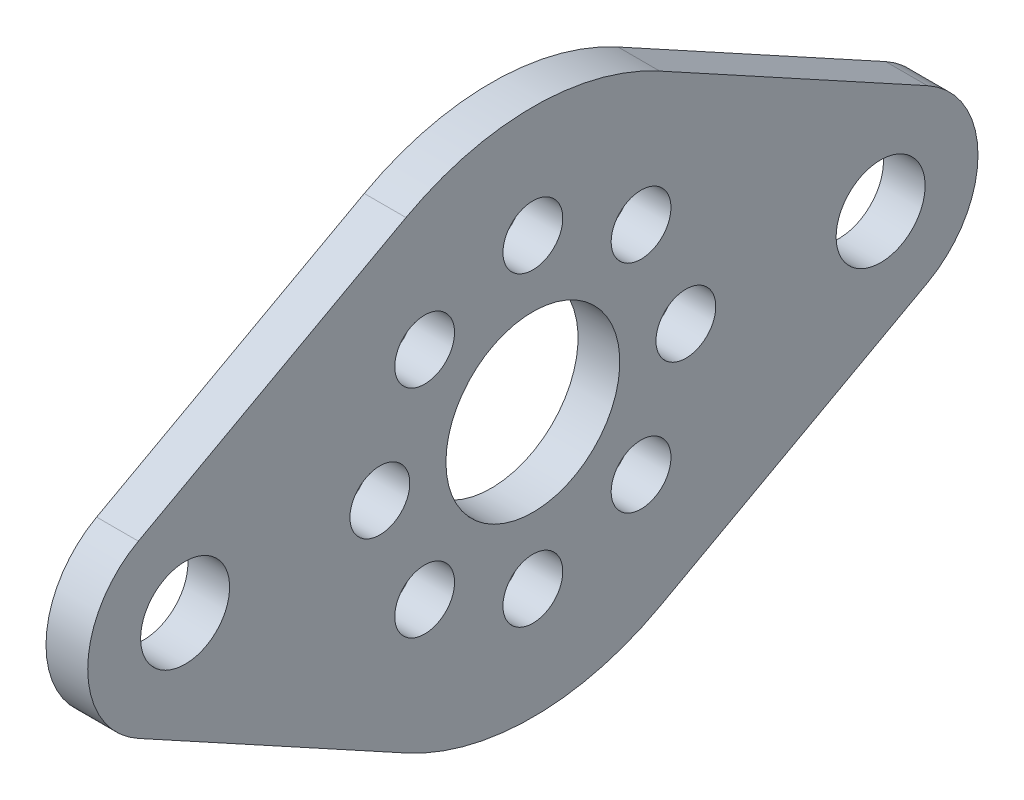
ISO-10303-21;
HEADER;
FILE_DESCRIPTION(('STEP AP214'),'2;1');
FILE_NAME('part.step','',(''),(''),'','','');
FILE_SCHEMA(('AUTOMOTIVE_DESIGN { 1 0 10303 214 1 1 1 1 }'));
ENDSEC;
DATA;
#1=APPLICATION_CONTEXT('core data for automotive mechanical design processes');
#2=APPLICATION_PROTOCOL_DEFINITION('international standard','automotive_design',2000,#1);
#3=PRODUCT_CONTEXT('',#1,'mechanical');
#4=PRODUCT('Part','Part','',(#3));
#5=PRODUCT_RELATED_PRODUCT_CATEGORY('part','',(#4));
#6=PRODUCT_DEFINITION_FORMATION('','',#4);
#7=PRODUCT_DEFINITION_CONTEXT('part definition',#1,'design');
#8=PRODUCT_DEFINITION('design','',#6,#7);
#9=PRODUCT_DEFINITION_SHAPE('','',#8);
#10=(LENGTH_UNIT() NAMED_UNIT(*) SI_UNIT(.MILLI.,.METRE.));
#11=(NAMED_UNIT(*) PLANE_ANGLE_UNIT() SI_UNIT($,.RADIAN.));
#12=(NAMED_UNIT(*) SI_UNIT($,.STERADIAN.) SOLID_ANGLE_UNIT());
#13=UNCERTAINTY_MEASURE_WITH_UNIT(LENGTH_MEASURE(1.E-05),#10,'distance_accuracy_value','');
#14=(GEOMETRIC_REPRESENTATION_CONTEXT(3) GLOBAL_UNCERTAINTY_ASSIGNED_CONTEXT((#13)) GLOBAL_UNIT_ASSIGNED_CONTEXT((#10,
#11,#12)) REPRESENTATION_CONTEXT('',''));
#15=CARTESIAN_POINT('',(0.,0.,0.));
#16=DIRECTION('',(0.,0.,1.));
#17=DIRECTION('',(1.,0.,0.));
#18=AXIS2_PLACEMENT_3D('',#15,#16,#17);
#19=CARTESIAN_POINT('',(-0.75,0.,12.5));
#20=DIRECTION('',(1.,0.,0.));
#21=DIRECTION('',(0.,0.,-1.));
#22=AXIS2_PLACEMENT_3D('',#19,#20,#21);
#23=PLANE('',#22);
#24=CARTESIAN_POINT('',(-0.75,0.,12.5));
#25=DIRECTION('',(-1.,0.,0.));
#26=DIRECTION('',(0.,0.,1.));
#27=AXIS2_PLACEMENT_3D('',#24,#25,#26);
#28=CIRCLE('',#27,1.6);
#29=CARTESIAN_POINT('',(-0.75,0.,14.1));
#30=VERTEX_POINT('',#29);
#31=EDGE_CURVE('E184',#30,#30,#28,.F.);
#32=ORIENTED_EDGE('',*,*,#31,.T.);
#33=EDGE_LOOP('',(#32));
#34=FACE_BOUND('',#33,.T.);
#35=CARTESIAN_POINT('',(-0.75,3.88908729652601,3.88908729652601));
#36=DIRECTION('',(-1.,0.,0.));
#37=DIRECTION('',(0.,0.,1.));
#38=AXIS2_PLACEMENT_3D('',#35,#36,#37);
#39=CIRCLE('',#38,1.075);
#40=CARTESIAN_POINT('',(-0.75,3.88908729652601,4.96408729652601));
#41=VERTEX_POINT('',#40);
#42=EDGE_CURVE('E235',#41,#41,#39,.F.);
#43=ORIENTED_EDGE('',*,*,#42,.T.);
#44=EDGE_LOOP('',(#43));
#45=FACE_BOUND('',#44,.T.);
#46=CARTESIAN_POINT('',(-0.75,0.,5.5));
#47=DIRECTION('',(-1.,0.,0.));
#48=DIRECTION('',(0.,0.,1.));
#49=AXIS2_PLACEMENT_3D('',#46,#47,#48);
#50=CIRCLE('',#49,1.075);
#51=CARTESIAN_POINT('',(-0.75,0.,6.575));
#52=VERTEX_POINT('',#51);
#53=EDGE_CURVE('E189',#52,#52,#50,.F.);
#54=ORIENTED_EDGE('',*,*,#53,.T.);
#55=EDGE_LOOP('',(#54));
#56=FACE_BOUND('',#55,.T.);
#57=CARTESIAN_POINT('',(-0.75,-3.88908729652601,3.88908729652601));
#58=DIRECTION('',(-1.,0.,0.));
#59=DIRECTION('',(0.,0.,1.));
#60=AXIS2_PLACEMENT_3D('',#57,#58,#59);
#61=CIRCLE('',#60,1.075);
#62=CARTESIAN_POINT('',(-0.75,-3.88908729652601,4.96408729652601));
#63=VERTEX_POINT('',#62);
#64=EDGE_CURVE('E230',#63,#63,#61,.F.);
#65=ORIENTED_EDGE('',*,*,#64,.T.);
#66=EDGE_LOOP('',(#65));
#67=FACE_BOUND('',#66,.T.);
#68=CARTESIAN_POINT('',(-0.75,-5.5,0.));
#69=DIRECTION('',(-1.,0.,0.));
#70=DIRECTION('',(0.,0.,1.));
#71=AXIS2_PLACEMENT_3D('',#68,#69,#70);
#72=CIRCLE('',#71,1.075);
#73=CARTESIAN_POINT('',(-0.75,-5.5,1.075));
#74=VERTEX_POINT('',#73);
#75=EDGE_CURVE('E194',#74,#74,#72,.F.);
#76=ORIENTED_EDGE('',*,*,#75,.T.);
#77=EDGE_LOOP('',(#76));
#78=FACE_BOUND('',#77,.T.);
#79=CARTESIAN_POINT('',(-0.75,-3.88908729652601,-3.88908729652601));
#80=DIRECTION('',(-1.,0.,0.));
#81=DIRECTION('',(0.,0.,1.));
#82=AXIS2_PLACEMENT_3D('',#79,#80,#81);
#83=CIRCLE('',#82,1.075);
#84=CARTESIAN_POINT('',(-0.75,-3.88908729652601,-2.81408729652601));
#85=VERTEX_POINT('',#84);
#86=EDGE_CURVE('E225',#85,#85,#83,.F.);
#87=ORIENTED_EDGE('',*,*,#86,.T.);
#88=EDGE_LOOP('',(#87));
#89=FACE_BOUND('',#88,.T.);
#90=CARTESIAN_POINT('',(-0.75,0.,-5.5));
#91=DIRECTION('',(-1.,0.,0.));
#92=DIRECTION('',(0.,0.,1.));
#93=AXIS2_PLACEMENT_3D('',#90,#91,#92);
#94=CIRCLE('',#93,1.075);
#95=CARTESIAN_POINT('',(-0.75,0.,-4.425));
#96=VERTEX_POINT('',#95);
#97=EDGE_CURVE('E199',#96,#96,#94,.F.);
#98=ORIENTED_EDGE('',*,*,#97,.T.);
#99=EDGE_LOOP('',(#98));
#100=FACE_BOUND('',#99,.T.);
#101=CARTESIAN_POINT('',(-0.75,3.88908729652601,-3.88908729652601));
#102=DIRECTION('',(-1.,0.,0.));
#103=DIRECTION('',(0.,0.,1.));
#104=AXIS2_PLACEMENT_3D('',#101,#102,#103);
#105=CIRCLE('',#104,1.075);
#106=CARTESIAN_POINT('',(-0.75,3.88908729652601,-2.81408729652601));
#107=VERTEX_POINT('',#106);
#108=EDGE_CURVE('E220',#107,#107,#105,.F.);
#109=ORIENTED_EDGE('',*,*,#108,.T.);
#110=EDGE_LOOP('',(#109));
#111=FACE_BOUND('',#110,.T.);
#112=CARTESIAN_POINT('',(-0.75,0.,-12.5));
#113=DIRECTION('',(-1.,0.,0.));
#114=DIRECTION('',(0.,0.,1.));
#115=AXIS2_PLACEMENT_3D('',#112,#113,#114);
#116=CIRCLE('',#115,1.6);
#117=CARTESIAN_POINT('',(-0.75,0.,-10.9));
#118=VERTEX_POINT('',#117);
#119=EDGE_CURVE('E104',#118,#118,#116,.F.);
#120=ORIENTED_EDGE('',*,*,#119,.T.);
#121=EDGE_LOOP('',(#120));
#122=FACE_BOUND('',#121,.T.);
#123=CARTESIAN_POINT('',(-0.75,5.5,0.));
#124=DIRECTION('',(-1.,0.,0.));
#125=DIRECTION('',(0.,0.,1.));
#126=AXIS2_PLACEMENT_3D('',#123,#124,#125);
#127=CIRCLE('',#126,1.075);
#128=CARTESIAN_POINT('',(-0.75,5.5,1.075));
#129=VERTEX_POINT('',#128);
#130=EDGE_CURVE('E90',#129,#129,#127,.F.);
#131=ORIENTED_EDGE('',*,*,#130,.T.);
#132=EDGE_LOOP('',(#131));
#133=FACE_BOUND('',#132,.T.);
#134=CARTESIAN_POINT('',(-0.75,0.,0.));
#135=DIRECTION('',(-1.,0.,0.));
#136=DIRECTION('',(0.,0.,1.));
#137=AXIS2_PLACEMENT_3D('',#134,#135,#136);
#138=CIRCLE('',#137,3.125);
#139=CARTESIAN_POINT('',(-0.75,0.,3.125));
#140=VERTEX_POINT('',#139);
#141=EDGE_CURVE('E101',#140,#140,#138,.F.);
#142=ORIENTED_EDGE('',*,*,#141,.T.);
#143=EDGE_LOOP('',(#142));
#144=FACE_BOUND('',#143,.T.);
#145=DIRECTION('',(0.,0.48,-0.877268487978452));
#146=VECTOR('',#145,1.);
#147=CARTESIAN_POINT('',(-0.75,3.07043970792458,14.18));
#148=LINE('',#147,#146);
#149=CARTESIAN_POINT('',(-0.75,3.07043970792458,14.18));
#150=VERTEX_POINT('',#149);
#151=CARTESIAN_POINT('',(-0.75,8.33405063579529,4.56));
#152=VERTEX_POINT('',#151);
#153=EDGE_CURVE('E84',#150,#152,#148,.T.);
#154=ORIENTED_EDGE('',*,*,#153,.T.);
#155=CARTESIAN_POINT('',(-0.75,0.,0.));
#156=DIRECTION('',(-1.,0.,0.));
#157=DIRECTION('',(0.,0.,1.));
#158=AXIS2_PLACEMENT_3D('',#155,#156,#157);
#159=CIRCLE('',#158,9.5);
#160=CARTESIAN_POINT('',(-0.75,8.33405063579529,-4.56));
#161=VERTEX_POINT('',#160);
#162=EDGE_CURVE('E112',#161,#152,#159,.F.);
#163=ORIENTED_EDGE('',*,*,#162,.F.);
#164=DIRECTION('',(0.,-0.48,-0.877268487978452));
#165=VECTOR('',#164,1.);
#166=CARTESIAN_POINT('',(-0.75,3.07043970792458,-14.18));
#167=LINE('',#166,#165);
#168=CARTESIAN_POINT('',(-0.75,3.07043970792458,-14.18));
#169=VERTEX_POINT('',#168);
#170=EDGE_CURVE('E109',#161,#169,#167,.T.);
#171=ORIENTED_EDGE('',*,*,#170,.T.);
#172=CARTESIAN_POINT('',(-0.75,0.,-12.5));
#173=DIRECTION('',(-1.,0.,0.));
#174=DIRECTION('',(0.,0.,1.));
#175=AXIS2_PLACEMENT_3D('',#172,#173,#174);
#176=CIRCLE('',#175,3.5);
#177=CARTESIAN_POINT('',(-0.75,-3.07043970792458,-14.18));
#178=VERTEX_POINT('',#177);
#179=EDGE_CURVE('E117',#178,#169,#176,.F.);
#180=ORIENTED_EDGE('',*,*,#179,.F.);
#181=DIRECTION('',(0.,-0.48,0.877268487978452));
#182=VECTOR('',#181,1.);
#183=CARTESIAN_POINT('',(-0.75,-3.07043970792458,-14.18));
#184=LINE('',#183,#182);
#185=CARTESIAN_POINT('',(-0.75,-8.33405063579529,-4.56));
#186=VERTEX_POINT('',#185);
#187=EDGE_CURVE('E114',#178,#186,#184,.T.);
#188=ORIENTED_EDGE('',*,*,#187,.T.);
#189=CARTESIAN_POINT('',(-0.75,0.,0.));
#190=DIRECTION('',(-1.,0.,0.));
#191=DIRECTION('',(0.,0.,1.));
#192=AXIS2_PLACEMENT_3D('',#189,#190,#191);
#193=CIRCLE('',#192,9.5);
#194=CARTESIAN_POINT('',(-0.75,-8.33405063579529,4.56));
#195=VERTEX_POINT('',#194);
#196=EDGE_CURVE('E119',#195,#186,#193,.F.);
#197=ORIENTED_EDGE('',*,*,#196,.F.);
#198=DIRECTION('',(0.,0.48,0.877268487978452));
#199=VECTOR('',#198,1.);
#200=CARTESIAN_POINT('',(-0.75,-3.07043970792458,14.18));
#201=LINE('',#200,#199);
#202=CARTESIAN_POINT('',(-0.75,-3.07043970792458,14.18));
#203=VERTEX_POINT('',#202);
#204=EDGE_CURVE('E86',#195,#203,#201,.T.);
#205=ORIENTED_EDGE('',*,*,#204,.T.);
#206=CARTESIAN_POINT('',(-0.75,0.,12.5));
#207=DIRECTION('',(-1.,0.,0.));
#208=DIRECTION('',(0.,0.,1.));
#209=AXIS2_PLACEMENT_3D('',#206,#207,#208);
#210=CIRCLE('',#209,3.5);
#211=EDGE_CURVE('E81',#150,#203,#210,.F.);
#212=ORIENTED_EDGE('',*,*,#211,.F.);
#213=EDGE_LOOP('',(#154,#163,#171,#180,#188,#197,#205,#212));
#214=FACE_BOUND('',#213,.T.);
#215=ADVANCED_FACE('F18',(#34,#45,#56,#67,#78,#89,#100,#111,#122,#133,#144,#214),#23,.F.);
#216=CARTESIAN_POINT('',(0.75,3.88908729652601,3.88908729652601));
#217=DIRECTION('',(-1.,0.,0.));
#218=DIRECTION('',(0.,0.,1.));
#219=AXIS2_PLACEMENT_3D('',#216,#217,#218);
#220=CYLINDRICAL_SURFACE('',#219,1.075);
#221=ORIENTED_EDGE('',*,*,#42,.F.);
#222=EDGE_LOOP('',(#221));
#223=FACE_BOUND('',#222,.T.);
#224=CARTESIAN_POINT('',(0.75,3.88908729652601,3.88908729652601));
#225=DIRECTION('',(-1.,0.,0.));
#226=DIRECTION('',(0.,0.,1.));
#227=AXIS2_PLACEMENT_3D('',#224,#225,#226);
#228=CIRCLE('',#227,1.075);
#229=CARTESIAN_POINT('',(0.75,3.88908729652601,4.96408729652601));
#230=VERTEX_POINT('',#229);
#231=EDGE_CURVE('E179',#230,#230,#228,.T.);
#232=ORIENTED_EDGE('',*,*,#231,.F.);
#233=EDGE_LOOP('',(#232));
#234=FACE_BOUND('',#233,.T.);
#235=ADVANCED_FACE('F242',(#223,#234),#220,.F.);
#236=CARTESIAN_POINT('',(0.75,-3.88908729652601,3.88908729652601));
#237=DIRECTION('',(-1.,0.,0.));
#238=DIRECTION('',(0.,0.,1.));
#239=AXIS2_PLACEMENT_3D('',#236,#237,#238);
#240=CYLINDRICAL_SURFACE('',#239,1.075);
#241=ORIENTED_EDGE('',*,*,#64,.F.);
#242=EDGE_LOOP('',(#241));
#243=FACE_BOUND('',#242,.T.);
#244=CARTESIAN_POINT('',(0.75,-3.88908729652601,3.88908729652601));
#245=DIRECTION('',(-1.,0.,0.));
#246=DIRECTION('',(0.,0.,1.));
#247=AXIS2_PLACEMENT_3D('',#244,#245,#246);
#248=CIRCLE('',#247,1.075);
#249=CARTESIAN_POINT('',(0.75,-3.88908729652601,4.96408729652601));
#250=VERTEX_POINT('',#249);
#251=EDGE_CURVE('E174',#250,#250,#248,.T.);
#252=ORIENTED_EDGE('',*,*,#251,.F.);
#253=EDGE_LOOP('',(#252));
#254=FACE_BOUND('',#253,.T.);
#255=ADVANCED_FACE('F245',(#243,#254),#240,.F.);
#256=CARTESIAN_POINT('',(0.75,-3.88908729652601,-3.88908729652601));
#257=DIRECTION('',(-1.,0.,0.));
#258=DIRECTION('',(0.,0.,1.));
#259=AXIS2_PLACEMENT_3D('',#256,#257,#258);
#260=CYLINDRICAL_SURFACE('',#259,1.075);
#261=ORIENTED_EDGE('',*,*,#86,.F.);
#262=EDGE_LOOP('',(#261));
#263=FACE_BOUND('',#262,.T.);
#264=CARTESIAN_POINT('',(0.75,-3.88908729652601,-3.88908729652601));
#265=DIRECTION('',(-1.,0.,0.));
#266=DIRECTION('',(0.,0.,1.));
#267=AXIS2_PLACEMENT_3D('',#264,#265,#266);
#268=CIRCLE('',#267,1.075);
#269=CARTESIAN_POINT('',(0.75,-3.88908729652601,-2.81408729652601));
#270=VERTEX_POINT('',#269);
#271=EDGE_CURVE('E169',#270,#270,#268,.T.);
#272=ORIENTED_EDGE('',*,*,#271,.F.);
#273=EDGE_LOOP('',(#272));
#274=FACE_BOUND('',#273,.T.);
#275=ADVANCED_FACE('F315',(#263,#274),#260,.F.);
#276=CARTESIAN_POINT('',(0.75,3.88908729652601,-3.88908729652601));
#277=DIRECTION('',(-1.,0.,0.));
#278=DIRECTION('',(0.,0.,1.));
#279=AXIS2_PLACEMENT_3D('',#276,#277,#278);
#280=CYLINDRICAL_SURFACE('',#279,1.075);
#281=ORIENTED_EDGE('',*,*,#108,.F.);
#282=EDGE_LOOP('',(#281));
#283=FACE_BOUND('',#282,.T.);
#284=CARTESIAN_POINT('',(0.75,3.88908729652601,-3.88908729652601));
#285=DIRECTION('',(-1.,0.,0.));
#286=DIRECTION('',(0.,0.,1.));
#287=AXIS2_PLACEMENT_3D('',#284,#285,#286);
#288=CIRCLE('',#287,1.075);
#289=CARTESIAN_POINT('',(0.75,3.88908729652601,-2.81408729652601));
#290=VERTEX_POINT('',#289);
#291=EDGE_CURVE('E164',#290,#290,#288,.T.);
#292=ORIENTED_EDGE('',*,*,#291,.F.);
#293=EDGE_LOOP('',(#292));
#294=FACE_BOUND('',#293,.T.);
#295=ADVANCED_FACE('F311',(#283,#294),#280,.F.);
#296=CARTESIAN_POINT('',(0.75,5.5,0.));
#297=DIRECTION('',(-1.,0.,0.));
#298=DIRECTION('',(0.,0.,1.));
#299=AXIS2_PLACEMENT_3D('',#296,#297,#298);
#300=CYLINDRICAL_SURFACE('',#299,1.075);
#301=ORIENTED_EDGE('',*,*,#130,.F.);
#302=EDGE_LOOP('',(#301));
#303=FACE_BOUND('',#302,.T.);
#304=CARTESIAN_POINT('',(0.75,5.5,0.));
#305=DIRECTION('',(-1.,0.,0.));
#306=DIRECTION('',(0.,0.,1.));
#307=AXIS2_PLACEMENT_3D('',#304,#305,#306);
#308=CIRCLE('',#307,1.075);
#309=CARTESIAN_POINT('',(0.75,5.5,1.075));
#310=VERTEX_POINT('',#309);
#311=EDGE_CURVE('E161',#310,#310,#308,.T.);
#312=ORIENTED_EDGE('',*,*,#311,.F.);
#313=EDGE_LOOP('',(#312));
#314=FACE_BOUND('',#313,.T.);
#315=ADVANCED_FACE('F308',(#303,#314),#300,.F.);
#316=CARTESIAN_POINT('',(0.75,0.,12.5));
#317=DIRECTION('',(-1.,0.,0.));
#318=DIRECTION('',(0.,0.,1.));
#319=AXIS2_PLACEMENT_3D('',#316,#317,#318);
#320=CYLINDRICAL_SURFACE('',#319,3.5);
#321=CARTESIAN_POINT('',(0.75,0.,12.5));
#322=DIRECTION('',(-1.,0.,0.));
#323=DIRECTION('',(0.,0.,1.));
#324=AXIS2_PLACEMENT_3D('',#321,#322,#323);
#325=CIRCLE('',#324,3.5);
#326=CARTESIAN_POINT('',(0.75,3.07043970792458,14.18));
#327=VERTEX_POINT('',#326);
#328=CARTESIAN_POINT('',(0.75,-3.07043970792458,14.18));
#329=VERTEX_POINT('',#328);
#330=EDGE_CURVE('E96',#327,#329,#325,.F.);
#331=ORIENTED_EDGE('',*,*,#330,.F.);
#332=DIRECTION('',(1.,0.,0.));
#333=VECTOR('',#332,1.);
#334=CARTESIAN_POINT('',(0.75,3.07043970792458,14.18));
#335=LINE('',#334,#333);
#336=EDGE_CURVE('E93',#327,#150,#335,.F.);
#337=ORIENTED_EDGE('',*,*,#336,.T.);
#338=ORIENTED_EDGE('',*,*,#211,.T.);
#339=DIRECTION('',(1.,0.,0.));
#340=VECTOR('',#339,1.);
#341=CARTESIAN_POINT('',(0.75,-3.07043970792458,14.18));
#342=LINE('',#341,#340);
#343=EDGE_CURVE('E89',#203,#329,#342,.T.);
#344=ORIENTED_EDGE('',*,*,#343,.T.);
#345=EDGE_LOOP('',(#331,#337,#338,#344));
#346=FACE_BOUND('',#345,.T.);
#347=ADVANCED_FACE('F94',(#346),#320,.T.);
#348=CARTESIAN_POINT('',(0.75,-3.07043970792458,14.18));
#349=DIRECTION('',(0.,0.877268487978452,-0.48));
#350=DIRECTION('',(0.,0.48,0.877268487978452));
#351=AXIS2_PLACEMENT_3D('',#348,#349,#350);
#352=PLANE('',#351);
#353=DIRECTION('',(-1.,0.,0.));
#354=VECTOR('',#353,1.);
#355=CARTESIAN_POINT('',(0.75,-8.33405063579529,4.56));
#356=LINE('',#355,#354);
#357=CARTESIAN_POINT('',(0.75,-8.33405063579529,4.56));
#358=VERTEX_POINT('',#357);
#359=EDGE_CURVE('E216',#358,#195,#356,.T.);
#360=ORIENTED_EDGE('',*,*,#359,.F.);
#361=DIRECTION('',(0.,-0.48,-0.877268487978452));
#362=VECTOR('',#361,1.);
#363=CARTESIAN_POINT('',(0.75,-3.07043970792458,14.18));
#364=LINE('',#363,#362);
#365=EDGE_CURVE('E159',#329,#358,#364,.T.);
#366=ORIENTED_EDGE('',*,*,#365,.F.);
#367=ORIENTED_EDGE('',*,*,#343,.F.);
#368=ORIENTED_EDGE('',*,*,#204,.F.);
#369=EDGE_LOOP('',(#360,#366,#367,#368));
#370=FACE_BOUND('',#369,.T.);
#371=ADVANCED_FACE('F301',(#370),#352,.F.);
#372=CARTESIAN_POINT('',(0.75,0.,0.));
#373=DIRECTION('',(-1.,0.,0.));
#374=DIRECTION('',(0.,0.,1.));
#375=AXIS2_PLACEMENT_3D('',#372,#373,#374);
#376=CYLINDRICAL_SURFACE('',#375,9.5);
#377=CARTESIAN_POINT('',(0.75,0.,0.));
#378=DIRECTION('',(-1.,0.,0.));
#379=DIRECTION('',(0.,0.,1.));
#380=AXIS2_PLACEMENT_3D('',#377,#378,#379);
#381=CIRCLE('',#380,9.5);
#382=CARTESIAN_POINT('',(0.75,-8.33405063579529,-4.56));
#383=VERTEX_POINT('',#382);
#384=EDGE_CURVE('E156',#358,#383,#381,.F.);
#385=ORIENTED_EDGE('',*,*,#384,.F.);
#386=ORIENTED_EDGE('',*,*,#359,.T.);
#387=ORIENTED_EDGE('',*,*,#196,.T.);
#388=DIRECTION('',(1.,0.,0.));
#389=VECTOR('',#388,1.);
#390=CARTESIAN_POINT('',(0.75,-8.33405063579529,-4.56));
#391=LINE('',#390,#389);
#392=EDGE_CURVE('E118',#186,#383,#391,.T.);
#393=ORIENTED_EDGE('',*,*,#392,.T.);
#394=EDGE_LOOP('',(#385,#386,#387,#393));
#395=FACE_BOUND('',#394,.T.);
#396=ADVANCED_FACE('F297',(#395),#376,.T.);
#397=CARTESIAN_POINT('',(0.75,-3.07043970792458,-14.18));
#398=DIRECTION('',(0.,0.877268487978452,0.48));
#399=DIRECTION('',(0.,-0.48,0.877268487978452));
#400=AXIS2_PLACEMENT_3D('',#397,#398,#399);
#401=PLANE('',#400);
#402=DIRECTION('',(-1.,0.,0.));
#403=VECTOR('',#402,1.);
#404=CARTESIAN_POINT('',(0.75,-3.07043970792458,-14.18));
#405=LINE('',#404,#403);
#406=CARTESIAN_POINT('',(0.75,-3.07043970792458,-14.18));
#407=VERTEX_POINT('',#406);
#408=EDGE_CURVE('E215',#407,#178,#405,.T.);
#409=ORIENTED_EDGE('',*,*,#408,.F.);
#410=DIRECTION('',(0.,0.48,-0.877268487978452));
#411=VECTOR('',#410,1.);
#412=CARTESIAN_POINT('',(0.75,-8.33405063579529,-4.56));
#413=LINE('',#412,#411);
#414=EDGE_CURVE('E155',#383,#407,#413,.T.);
#415=ORIENTED_EDGE('',*,*,#414,.F.);
#416=ORIENTED_EDGE('',*,*,#392,.F.);
#417=ORIENTED_EDGE('',*,*,#187,.F.);
#418=EDGE_LOOP('',(#409,#415,#416,#417));
#419=FACE_BOUND('',#418,.T.);
#420=ADVANCED_FACE('F293',(#419),#401,.F.);
#421=CARTESIAN_POINT('',(0.75,0.,-12.5));
#422=DIRECTION('',(-1.,0.,0.));
#423=DIRECTION('',(0.,0.,1.));
#424=AXIS2_PLACEMENT_3D('',#421,#422,#423);
#425=CYLINDRICAL_SURFACE('',#424,3.5);
#426=CARTESIAN_POINT('',(0.75,0.,-12.5));
#427=DIRECTION('',(-1.,0.,0.));
#428=DIRECTION('',(0.,0.,1.));
#429=AXIS2_PLACEMENT_3D('',#426,#427,#428);
#430=CIRCLE('',#429,3.5);
#431=CARTESIAN_POINT('',(0.75,3.07043970792458,-14.18));
#432=VERTEX_POINT('',#431);
#433=EDGE_CURVE('E152',#407,#432,#430,.F.);
#434=ORIENTED_EDGE('',*,*,#433,.F.);
#435=ORIENTED_EDGE('',*,*,#408,.T.);
#436=ORIENTED_EDGE('',*,*,#179,.T.);
#437=DIRECTION('',(1.,0.,0.));
#438=VECTOR('',#437,1.);
#439=CARTESIAN_POINT('',(0.75,3.07043970792458,-14.18));
#440=LINE('',#439,#438);
#441=EDGE_CURVE('E113',#169,#432,#440,.T.);
#442=ORIENTED_EDGE('',*,*,#441,.T.);
#443=EDGE_LOOP('',(#434,#435,#436,#442));
#444=FACE_BOUND('',#443,.T.);
#445=ADVANCED_FACE('F289',(#444),#425,.T.);
#446=CARTESIAN_POINT('',(0.75,3.07043970792458,-14.18));
#447=DIRECTION('',(0.,-0.877268487978452,0.48));
#448=DIRECTION('',(0.,-0.48,-0.877268487978452));
#449=AXIS2_PLACEMENT_3D('',#446,#447,#448);
#450=PLANE('',#449);
#451=DIRECTION('',(-1.,0.,0.));
#452=VECTOR('',#451,1.);
#453=CARTESIAN_POINT('',(0.75,8.33405063579529,-4.56));
#454=LINE('',#453,#452);
#455=CARTESIAN_POINT('',(0.75,8.33405063579529,-4.56));
#456=VERTEX_POINT('',#455);
#457=EDGE_CURVE('E213',#456,#161,#454,.T.);
#458=ORIENTED_EDGE('',*,*,#457,.F.);
#459=DIRECTION('',(0.,0.48,0.877268487978452));
#460=VECTOR('',#459,1.);
#461=CARTESIAN_POINT('',(0.75,3.07043970792458,-14.18));
#462=LINE('',#461,#460);
#463=EDGE_CURVE('E151',#432,#456,#462,.T.);
#464=ORIENTED_EDGE('',*,*,#463,.F.);
#465=ORIENTED_EDGE('',*,*,#441,.F.);
#466=ORIENTED_EDGE('',*,*,#170,.F.);
#467=EDGE_LOOP('',(#458,#464,#465,#466));
#468=FACE_BOUND('',#467,.T.);
#469=ADVANCED_FACE('F286',(#468),#450,.F.);
#470=CARTESIAN_POINT('',(0.75,0.,0.));
#471=DIRECTION('',(-1.,0.,0.));
#472=DIRECTION('',(0.,0.,1.));
#473=AXIS2_PLACEMENT_3D('',#470,#471,#472);
#474=CYLINDRICAL_SURFACE('',#473,9.5);
#475=CARTESIAN_POINT('',(0.75,0.,0.));
#476=DIRECTION('',(-1.,0.,0.));
#477=DIRECTION('',(0.,0.,1.));
#478=AXIS2_PLACEMENT_3D('',#475,#476,#477);
#479=CIRCLE('',#478,9.5);
#480=CARTESIAN_POINT('',(0.75,8.33405063579529,4.56));
#481=VERTEX_POINT('',#480);
#482=EDGE_CURVE('E148',#456,#481,#479,.F.);
#483=ORIENTED_EDGE('',*,*,#482,.F.);
#484=ORIENTED_EDGE('',*,*,#457,.T.);
#485=ORIENTED_EDGE('',*,*,#162,.T.);
#486=DIRECTION('',(1.,0.,0.));
#487=VECTOR('',#486,1.);
#488=CARTESIAN_POINT('',(0.75,8.33405063579529,4.56));
#489=LINE('',#488,#487);
#490=EDGE_CURVE('E36',#152,#481,#489,.T.);
#491=ORIENTED_EDGE('',*,*,#490,.T.);
#492=EDGE_LOOP('',(#483,#484,#485,#491));
#493=FACE_BOUND('',#492,.T.);
#494=ADVANCED_FACE('F283',(#493),#474,.T.);
#495=CARTESIAN_POINT('',(0.75,3.07043970792458,14.18));
#496=DIRECTION('',(0.,-0.877268487978452,-0.48));
#497=DIRECTION('',(0.,0.48,-0.877268487978452));
#498=AXIS2_PLACEMENT_3D('',#495,#496,#497);
#499=PLANE('',#498);
#500=ORIENTED_EDGE('',*,*,#336,.F.);
#501=DIRECTION('',(0.,-0.48,0.877268487978452));
#502=VECTOR('',#501,1.);
#503=CARTESIAN_POINT('',(0.75,8.33405063579529,4.56));
#504=LINE('',#503,#502);
#505=EDGE_CURVE('E145',#481,#327,#504,.T.);
#506=ORIENTED_EDGE('',*,*,#505,.F.);
#507=ORIENTED_EDGE('',*,*,#490,.F.);
#508=ORIENTED_EDGE('',*,*,#153,.F.);
#509=EDGE_LOOP('',(#500,#506,#507,#508));
#510=FACE_BOUND('',#509,.T.);
#511=ADVANCED_FACE('F100',(#510),#499,.F.);
#512=CARTESIAN_POINT('',(0.75,0.,0.));
#513=DIRECTION('',(-1.,0.,0.));
#514=DIRECTION('',(0.,0.,1.));
#515=AXIS2_PLACEMENT_3D('',#512,#513,#514);
#516=CYLINDRICAL_SURFACE('',#515,3.125);
#517=ORIENTED_EDGE('',*,*,#141,.F.);
#518=EDGE_LOOP('',(#517));
#519=FACE_BOUND('',#518,.T.);
#520=CARTESIAN_POINT('',(0.75,0.,0.));
#521=DIRECTION('',(-1.,0.,0.));
#522=DIRECTION('',(0.,0.,1.));
#523=AXIS2_PLACEMENT_3D('',#520,#521,#522);
#524=CIRCLE('',#523,3.125);
#525=CARTESIAN_POINT('',(0.75,0.,3.125));
#526=VERTEX_POINT('',#525);
#527=EDGE_CURVE('E140',#526,#526,#524,.T.);
#528=ORIENTED_EDGE('',*,*,#527,.F.);
#529=EDGE_LOOP('',(#528));
#530=FACE_BOUND('',#529,.T.);
#531=ADVANCED_FACE('F276',(#519,#530),#516,.F.);
#532=CARTESIAN_POINT('',(0.75,0.,-12.5));
#533=DIRECTION('',(-1.,0.,0.));
#534=DIRECTION('',(0.,0.,1.));
#535=AXIS2_PLACEMENT_3D('',#532,#533,#534);
#536=CYLINDRICAL_SURFACE('',#535,1.6);
#537=ORIENTED_EDGE('',*,*,#119,.F.);
#538=EDGE_LOOP('',(#537));
#539=FACE_BOUND('',#538,.T.);
#540=CARTESIAN_POINT('',(0.75,0.,-12.5));
#541=DIRECTION('',(-1.,0.,0.));
#542=DIRECTION('',(0.,0.,1.));
#543=AXIS2_PLACEMENT_3D('',#540,#541,#542);
#544=CIRCLE('',#543,1.6);
#545=CARTESIAN_POINT('',(0.75,0.,-10.9));
#546=VERTEX_POINT('',#545);
#547=EDGE_CURVE('E135',#546,#546,#544,.T.);
#548=ORIENTED_EDGE('',*,*,#547,.F.);
#549=EDGE_LOOP('',(#548));
#550=FACE_BOUND('',#549,.T.);
#551=ADVANCED_FACE('F272',(#539,#550),#536,.F.);
#552=CARTESIAN_POINT('',(0.75,0.,-5.5));
#553=DIRECTION('',(-1.,0.,0.));
#554=DIRECTION('',(0.,0.,1.));
#555=AXIS2_PLACEMENT_3D('',#552,#553,#554);
#556=CYLINDRICAL_SURFACE('',#555,1.075);
#557=ORIENTED_EDGE('',*,*,#97,.F.);
#558=EDGE_LOOP('',(#557));
#559=FACE_BOUND('',#558,.T.);
#560=CARTESIAN_POINT('',(0.75,0.,-5.5));
#561=DIRECTION('',(-1.,0.,0.));
#562=DIRECTION('',(0.,0.,1.));
#563=AXIS2_PLACEMENT_3D('',#560,#561,#562);
#564=CIRCLE('',#563,1.075);
#565=CARTESIAN_POINT('',(0.75,0.,-4.425));
#566=VERTEX_POINT('',#565);
#567=EDGE_CURVE('E130',#566,#566,#564,.T.);
#568=ORIENTED_EDGE('',*,*,#567,.F.);
#569=EDGE_LOOP('',(#568));
#570=FACE_BOUND('',#569,.T.);
#571=ADVANCED_FACE('F268',(#559,#570),#556,.F.);
#572=CARTESIAN_POINT('',(0.75,-5.5,0.));
#573=DIRECTION('',(-1.,0.,0.));
#574=DIRECTION('',(0.,0.,1.));
#575=AXIS2_PLACEMENT_3D('',#572,#573,#574);
#576=CYLINDRICAL_SURFACE('',#575,1.075);
#577=ORIENTED_EDGE('',*,*,#75,.F.);
#578=EDGE_LOOP('',(#577));
#579=FACE_BOUND('',#578,.T.);
#580=CARTESIAN_POINT('',(0.75,-5.5,0.));
#581=DIRECTION('',(-1.,0.,0.));
#582=DIRECTION('',(0.,0.,1.));
#583=AXIS2_PLACEMENT_3D('',#580,#581,#582);
#584=CIRCLE('',#583,1.075);
#585=CARTESIAN_POINT('',(0.75,-5.5,1.075));
#586=VERTEX_POINT('',#585);
#587=EDGE_CURVE('E125',#586,#586,#584,.T.);
#588=ORIENTED_EDGE('',*,*,#587,.F.);
#589=EDGE_LOOP('',(#588));
#590=FACE_BOUND('',#589,.T.);
#591=ADVANCED_FACE('F264',(#579,#590),#576,.F.);
#592=CARTESIAN_POINT('',(0.75,0.,5.5));
#593=DIRECTION('',(-1.,0.,0.));
#594=DIRECTION('',(0.,0.,1.));
#595=AXIS2_PLACEMENT_3D('',#592,#593,#594);
#596=CYLINDRICAL_SURFACE('',#595,1.075);
#597=ORIENTED_EDGE('',*,*,#53,.F.);
#598=EDGE_LOOP('',(#597));
#599=FACE_BOUND('',#598,.T.);
#600=CARTESIAN_POINT('',(0.75,0.,5.5));
#601=DIRECTION('',(-1.,0.,0.));
#602=DIRECTION('',(0.,0.,1.));
#603=AXIS2_PLACEMENT_3D('',#600,#601,#602);
#604=CIRCLE('',#603,1.075);
#605=CARTESIAN_POINT('',(0.75,0.,6.575));
#606=VERTEX_POINT('',#605);
#607=EDGE_CURVE('E27',#606,#606,#604,.T.);
#608=ORIENTED_EDGE('',*,*,#607,.F.);
#609=EDGE_LOOP('',(#608));
#610=FACE_BOUND('',#609,.T.);
#611=ADVANCED_FACE('F257',(#599,#610),#596,.F.);
#612=CARTESIAN_POINT('',(0.75,0.,12.5));
#613=DIRECTION('',(-1.,0.,0.));
#614=DIRECTION('',(0.,0.,1.));
#615=AXIS2_PLACEMENT_3D('',#612,#613,#614);
#616=CYLINDRICAL_SURFACE('',#615,1.6);
#617=ORIENTED_EDGE('',*,*,#31,.F.);
#618=EDGE_LOOP('',(#617));
#619=FACE_BOUND('',#618,.T.);
#620=CARTESIAN_POINT('',(0.75,0.,12.5));
#621=DIRECTION('',(-1.,0.,0.));
#622=DIRECTION('',(0.,0.,1.));
#623=AXIS2_PLACEMENT_3D('',#620,#621,#622);
#624=CIRCLE('',#623,1.6);
#625=CARTESIAN_POINT('',(0.75,0.,14.1));
#626=VERTEX_POINT('',#625);
#627=EDGE_CURVE('E11',#626,#626,#624,.T.);
#628=ORIENTED_EDGE('',*,*,#627,.F.);
#629=EDGE_LOOP('',(#628));
#630=FACE_BOUND('',#629,.T.);
#631=ADVANCED_FACE('F250',(#619,#630),#616,.F.);
#632=CARTESIAN_POINT('',(0.75,0.,12.5));
#633=DIRECTION('',(1.,0.,0.));
#634=DIRECTION('',(0.,0.,-1.));
#635=AXIS2_PLACEMENT_3D('',#632,#633,#634);
#636=PLANE('',#635);
#637=ORIENTED_EDGE('',*,*,#627,.T.);
#638=EDGE_LOOP('',(#637));
#639=FACE_BOUND('',#638,.T.);
#640=ORIENTED_EDGE('',*,*,#607,.T.);
#641=EDGE_LOOP('',(#640));
#642=FACE_BOUND('',#641,.T.);
#643=ORIENTED_EDGE('',*,*,#587,.T.);
#644=EDGE_LOOP('',(#643));
#645=FACE_BOUND('',#644,.T.);
#646=ORIENTED_EDGE('',*,*,#567,.T.);
#647=EDGE_LOOP('',(#646));
#648=FACE_BOUND('',#647,.T.);
#649=ORIENTED_EDGE('',*,*,#547,.T.);
#650=EDGE_LOOP('',(#649));
#651=FACE_BOUND('',#650,.T.);
#652=ORIENTED_EDGE('',*,*,#527,.T.);
#653=EDGE_LOOP('',(#652));
#654=FACE_BOUND('',#653,.T.);
#655=ORIENTED_EDGE('',*,*,#482,.T.);
#656=ORIENTED_EDGE('',*,*,#505,.T.);
#657=ORIENTED_EDGE('',*,*,#330,.T.);
#658=ORIENTED_EDGE('',*,*,#365,.T.);
#659=ORIENTED_EDGE('',*,*,#384,.T.);
#660=ORIENTED_EDGE('',*,*,#414,.T.);
#661=ORIENTED_EDGE('',*,*,#433,.T.);
#662=ORIENTED_EDGE('',*,*,#463,.T.);
#663=EDGE_LOOP('',(#655,#656,#657,#658,#659,#660,#661,#662));
#664=FACE_BOUND('',#663,.T.);
#665=ORIENTED_EDGE('',*,*,#311,.T.);
#666=EDGE_LOOP('',(#665));
#667=FACE_BOUND('',#666,.T.);
#668=ORIENTED_EDGE('',*,*,#291,.T.);
#669=EDGE_LOOP('',(#668));
#670=FACE_BOUND('',#669,.T.);
#671=ORIENTED_EDGE('',*,*,#271,.T.);
#672=EDGE_LOOP('',(#671));
#673=FACE_BOUND('',#672,.T.);
#674=ORIENTED_EDGE('',*,*,#251,.T.);
#675=EDGE_LOOP('',(#674));
#676=FACE_BOUND('',#675,.T.);
#677=ORIENTED_EDGE('',*,*,#231,.T.);
#678=EDGE_LOOP('',(#677));
#679=FACE_BOUND('',#678,.T.);
#680=ADVANCED_FACE('F248',(#639,#642,#645,#648,#651,#654,#664,#667,#670,#673,#676,#679),#636,.T.);
#681=CLOSED_SHELL('',(#215,#235,#255,#275,#295,#315,#347,#371,#396,#420,#445,#469,#494,#511,
#531,#551,#571,#591,#611,#631,#680));
#682=MANIFOLD_SOLID_BREP('B1',#681);
#683=ADVANCED_BREP_SHAPE_REPRESENTATION('',(#18,#682),#14);
#684=SHAPE_DEFINITION_REPRESENTATION(#9,#683);
ENDSEC;
END-ISO-10303-21;
